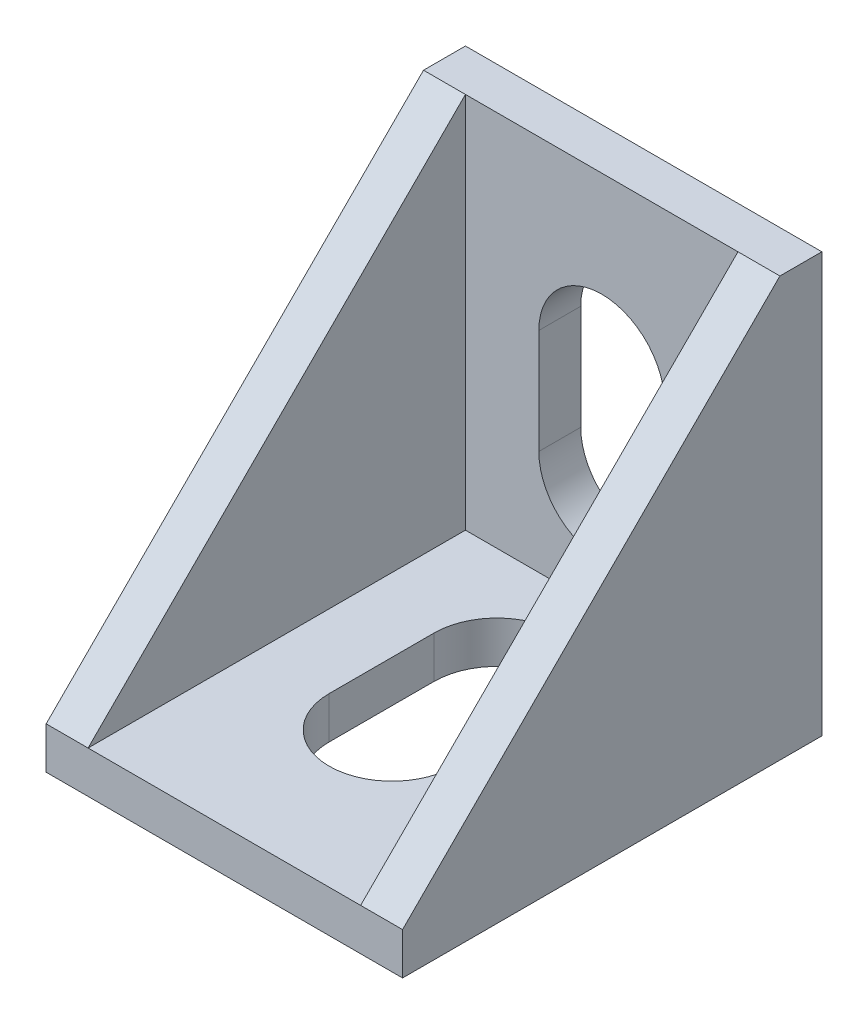
ISO-10303-21;
HEADER;
FILE_DESCRIPTION(('STEP AP214'),'2;1');
FILE_NAME('part.step','',(''),(''),'','','');
FILE_SCHEMA(('AUTOMOTIVE_DESIGN { 1 0 10303 214 1 1 1 1 }'));
ENDSEC;
DATA;
#1=APPLICATION_CONTEXT('core data for automotive mechanical design processes');
#2=APPLICATION_PROTOCOL_DEFINITION('international standard','automotive_design',2000,#1);
#3=PRODUCT_CONTEXT('',#1,'mechanical');
#4=PRODUCT('Part','Part','',(#3));
#5=PRODUCT_RELATED_PRODUCT_CATEGORY('part','',(#4));
#6=PRODUCT_DEFINITION_FORMATION('','',#4);
#7=PRODUCT_DEFINITION_CONTEXT('part definition',#1,'design');
#8=PRODUCT_DEFINITION('design','',#6,#7);
#9=PRODUCT_DEFINITION_SHAPE('','',#8);
#10=(LENGTH_UNIT() NAMED_UNIT(*) SI_UNIT(.MILLI.,.METRE.));
#11=(NAMED_UNIT(*) PLANE_ANGLE_UNIT() SI_UNIT($,.RADIAN.));
#12=(NAMED_UNIT(*) SI_UNIT($,.STERADIAN.) SOLID_ANGLE_UNIT());
#13=UNCERTAINTY_MEASURE_WITH_UNIT(LENGTH_MEASURE(1.E-05),#10,'distance_accuracy_value','');
#14=(GEOMETRIC_REPRESENTATION_CONTEXT(3) GLOBAL_UNCERTAINTY_ASSIGNED_CONTEXT((#13)) GLOBAL_UNIT_ASSIGNED_CONTEXT((#10,
#11,#12)) REPRESENTATION_CONTEXT('',''));
#15=CARTESIAN_POINT('',(0.,0.,0.));
#16=DIRECTION('',(0.,0.,1.));
#17=DIRECTION('',(1.,0.,0.));
#18=AXIS2_PLACEMENT_3D('',#15,#16,#17);
#19=CARTESIAN_POINT('',(0.,0.,0.));
#20=DIRECTION('',(0.,0.,-1.));
#21=DIRECTION('',(-1.,0.,0.));
#22=AXIS2_PLACEMENT_3D('',#19,#20,#21);
#23=PLANE('',#22);
#24=CARTESIAN_POINT('',(-1.,-7.99999999999999,0.));
#25=DIRECTION('',(0.,0.,-1.));
#26=DIRECTION('',(-1.,0.,0.));
#27=AXIS2_PLACEMENT_3D('',#24,#25,#26);
#28=CIRCLE('',#27,1.);
#29=CARTESIAN_POINT('',(-1.,-9.,0.));
#30=VERTEX_POINT('',#29);
#31=CARTESIAN_POINT('',(-1.,-6.99999999999999,0.));
#32=VERTEX_POINT('',#31);
#33=EDGE_CURVE('E59',#30,#32,#28,.T.);
#34=ORIENTED_EDGE('',*,*,#33,.F.);
#35=DIRECTION('',(-1.,0.,0.));
#36=VECTOR('',#35,1.);
#37=CARTESIAN_POINT('',(-1.,-9.,0.));
#38=LINE('',#37,#36);
#39=CARTESIAN_POINT('',(1.,-9.,0.));
#40=VERTEX_POINT('',#39);
#41=EDGE_CURVE('E279',#40,#30,#38,.T.);
#42=ORIENTED_EDGE('',*,*,#41,.F.);
#43=CARTESIAN_POINT('',(1.,-7.99999999999999,0.));
#44=DIRECTION('',(0.,0.,-1.));
#45=DIRECTION('',(-1.,0.,0.));
#46=AXIS2_PLACEMENT_3D('',#43,#44,#45);
#47=CIRCLE('',#46,1.);
#48=CARTESIAN_POINT('',(1.,-6.99999999999999,0.));
#49=VERTEX_POINT('',#48);
#50=EDGE_CURVE('E288',#49,#40,#47,.T.);
#51=ORIENTED_EDGE('',*,*,#50,.F.);
#52=DIRECTION('',(1.,0.,0.));
#53=VECTOR('',#52,1.);
#54=CARTESIAN_POINT('',(-1.,-6.99999999999999,0.));
#55=LINE('',#54,#53);
#56=EDGE_CURVE('E270',#32,#49,#55,.T.);
#57=ORIENTED_EDGE('',*,*,#56,.F.);
#58=EDGE_LOOP('',(#34,#42,#51,#57));
#59=FACE_BOUND('',#58,.T.);
#60=CARTESIAN_POINT('',(0.,-3.,0.));
#61=DIRECTION('',(0.,0.,-1.));
#62=DIRECTION('',(-1.,0.,0.));
#63=AXIS2_PLACEMENT_3D('',#60,#61,#62);
#64=CIRCLE('',#63,3.);
#65=CARTESIAN_POINT('',(-3.,-3.,0.));
#66=VERTEX_POINT('',#65);
#67=CARTESIAN_POINT('',(3.,-3.,0.));
#68=VERTEX_POINT('',#67);
#69=EDGE_CURVE('E375',#66,#68,#64,.F.);
#70=ORIENTED_EDGE('',*,*,#69,.T.);
#71=DIRECTION('',(0.,1.,0.));
#72=VECTOR('',#71,1.);
#73=CARTESIAN_POINT('',(3.,-3.,0.));
#74=LINE('',#73,#72);
#75=CARTESIAN_POINT('',(3.,2.,0.));
#76=VERTEX_POINT('',#75);
#77=EDGE_CURVE('E392',#68,#76,#74,.T.);
#78=ORIENTED_EDGE('',*,*,#77,.T.);
#79=CARTESIAN_POINT('',(0.,2.,0.));
#80=DIRECTION('',(0.,0.,-1.));
#81=DIRECTION('',(-1.,0.,0.));
#82=AXIS2_PLACEMENT_3D('',#79,#80,#81);
#83=CIRCLE('',#82,3.);
#84=CARTESIAN_POINT('',(-3.,2.,0.));
#85=VERTEX_POINT('',#84);
#86=EDGE_CURVE('E369',#76,#85,#83,.F.);
#87=ORIENTED_EDGE('',*,*,#86,.T.);
#88=DIRECTION('',(0.,-1.,0.));
#89=VECTOR('',#88,1.);
#90=CARTESIAN_POINT('',(-3.,-3.,0.));
#91=LINE('',#90,#89);
#92=EDGE_CURVE('E372',#85,#66,#91,.T.);
#93=ORIENTED_EDGE('',*,*,#92,.T.);
#94=EDGE_LOOP('',(#70,#78,#87,#93));
#95=FACE_BOUND('',#94,.T.);
#96=DIRECTION('',(0.,1.,0.));
#97=VECTOR('',#96,1.);
#98=CARTESIAN_POINT('',(8.5,-10.,0.));
#99=LINE('',#98,#97);
#100=CARTESIAN_POINT('',(8.5,-10.,0.));
#101=VERTEX_POINT('',#100);
#102=CARTESIAN_POINT('',(8.5,10.,0.));
#103=VERTEX_POINT('',#102);
#104=EDGE_CURVE('E470',#101,#103,#99,.T.);
#105=ORIENTED_EDGE('',*,*,#104,.F.);
#106=DIRECTION('',(1.,0.,0.));
#107=VECTOR('',#106,1.);
#108=CARTESIAN_POINT('',(-8.5,-10.,0.));
#109=LINE('',#108,#107);
#110=CARTESIAN_POINT('',(-8.5,-10.,0.));
#111=VERTEX_POINT('',#110);
#112=EDGE_CURVE('E477',#111,#101,#109,.T.);
#113=ORIENTED_EDGE('',*,*,#112,.F.);
#114=DIRECTION('',(0.,-1.,0.));
#115=VECTOR('',#114,1.);
#116=CARTESIAN_POINT('',(-8.5,-10.,0.));
#117=LINE('',#116,#115);
#118=CARTESIAN_POINT('',(-8.5,10.,0.));
#119=VERTEX_POINT('',#118);
#120=EDGE_CURVE('E487',#119,#111,#117,.T.);
#121=ORIENTED_EDGE('',*,*,#120,.F.);
#122=DIRECTION('',(-1.,0.,0.));
#123=VECTOR('',#122,1.);
#124=CARTESIAN_POINT('',(-8.5,10.,0.));
#125=LINE('',#124,#123);
#126=EDGE_CURVE('E484',#103,#119,#125,.T.);
#127=ORIENTED_EDGE('',*,*,#126,.F.);
#128=EDGE_LOOP('',(#105,#113,#121,#127));
#129=FACE_BOUND('',#128,.T.);
#130=DIRECTION('',(1.,0.,0.));
#131=VECTOR('',#130,1.);
#132=CARTESIAN_POINT('',(-1.,9.,0.));
#133=LINE('',#132,#131);
#134=CARTESIAN_POINT('',(-1.,9.,0.));
#135=VERTEX_POINT('',#134);
#136=CARTESIAN_POINT('',(1.,9.,0.));
#137=VERTEX_POINT('',#136);
#138=EDGE_CURVE('E931',#135,#137,#133,.T.);
#139=ORIENTED_EDGE('',*,*,#138,.F.);
#140=CARTESIAN_POINT('',(-1.,8.,0.));
#141=DIRECTION('',(0.,0.,-1.));
#142=DIRECTION('',(-1.,0.,0.));
#143=AXIS2_PLACEMENT_3D('',#140,#141,#142);
#144=CIRCLE('',#143,0.999999999999999);
#145=CARTESIAN_POINT('',(-1.,7.,0.));
#146=VERTEX_POINT('',#145);
#147=EDGE_CURVE('E267',#146,#135,#144,.T.);
#148=ORIENTED_EDGE('',*,*,#147,.F.);
#149=DIRECTION('',(-1.,0.,0.));
#150=VECTOR('',#149,1.);
#151=CARTESIAN_POINT('',(-1.,7.,0.));
#152=LINE('',#151,#150);
#153=CARTESIAN_POINT('',(1.,7.,0.));
#154=VERTEX_POINT('',#153);
#155=EDGE_CURVE('E263',#154,#146,#152,.T.);
#156=ORIENTED_EDGE('',*,*,#155,.F.);
#157=CARTESIAN_POINT('',(1.,8.,0.));
#158=DIRECTION('',(0.,0.,-1.));
#159=DIRECTION('',(-1.,0.,0.));
#160=AXIS2_PLACEMENT_3D('',#157,#158,#159);
#161=CIRCLE('',#160,0.999999999999999);
#162=EDGE_CURVE('E928',#137,#154,#161,.T.);
#163=ORIENTED_EDGE('',*,*,#162,.F.);
#164=EDGE_LOOP('',(#139,#148,#156,#163));
#165=FACE_BOUND('',#164,.T.);
#166=ADVANCED_FACE('F36',(#59,#95,#129,#165),#23,.T.);
#167=CARTESIAN_POINT('',(-8.5,-10.,20.));
#168=DIRECTION('',(0.,1.,0.));
#169=DIRECTION('',(0.,0.,1.));
#170=AXIS2_PLACEMENT_3D('',#167,#168,#169);
#171=PLANE('',#170);
#172=CARTESIAN_POINT('',(-1.,-10.,18.));
#173=DIRECTION('',(0.,-1.,0.));
#174=DIRECTION('',(0.,0.,-1.));
#175=AXIS2_PLACEMENT_3D('',#172,#173,#174);
#176=CIRCLE('',#175,1.);
#177=CARTESIAN_POINT('',(-1.,-10.,19.));
#178=VERTEX_POINT('',#177);
#179=CARTESIAN_POINT('',(-1.,-10.,17.));
#180=VERTEX_POINT('',#179);
#181=EDGE_CURVE('E336',#178,#180,#176,.T.);
#182=ORIENTED_EDGE('',*,*,#181,.F.);
#183=DIRECTION('',(-1.,0.,0.));
#184=VECTOR('',#183,1.);
#185=CARTESIAN_POINT('',(-1.,-10.,19.));
#186=LINE('',#185,#184);
#187=CARTESIAN_POINT('',(1.,-10.,19.));
#188=VERTEX_POINT('',#187);
#189=EDGE_CURVE('E341',#188,#178,#186,.T.);
#190=ORIENTED_EDGE('',*,*,#189,.F.);
#191=CARTESIAN_POINT('',(1.,-10.,18.));
#192=DIRECTION('',(0.,-1.,0.));
#193=DIRECTION('',(0.,0.,-1.));
#194=AXIS2_PLACEMENT_3D('',#191,#192,#193);
#195=CIRCLE('',#194,1.);
#196=CARTESIAN_POINT('',(1.,-10.,17.));
#197=VERTEX_POINT('',#196);
#198=EDGE_CURVE('E353',#197,#188,#195,.T.);
#199=ORIENTED_EDGE('',*,*,#198,.F.);
#200=DIRECTION('',(1.,0.,0.));
#201=VECTOR('',#200,1.);
#202=CARTESIAN_POINT('',(-1.,-10.,17.));
#203=LINE('',#202,#201);
#204=EDGE_CURVE('E350',#180,#197,#203,.T.);
#205=ORIENTED_EDGE('',*,*,#204,.F.);
#206=EDGE_LOOP('',(#182,#190,#199,#205));
#207=FACE_BOUND('',#206,.T.);
#208=DIRECTION('',(0.,0.,-1.));
#209=VECTOR('',#208,1.);
#210=CARTESIAN_POINT('',(-3.,-10.,12.));
#211=LINE('',#210,#209);
#212=CARTESIAN_POINT('',(-3.,-10.,12.));
#213=VERTEX_POINT('',#212);
#214=CARTESIAN_POINT('',(-3.,-10.,7.));
#215=VERTEX_POINT('',#214);
#216=EDGE_CURVE('E403',#213,#215,#211,.T.);
#217=ORIENTED_EDGE('',*,*,#216,.F.);
#218=CARTESIAN_POINT('',(0.,-10.,12.));
#219=DIRECTION('',(0.,1.,0.));
#220=DIRECTION('',(0.,0.,1.));
#221=AXIS2_PLACEMENT_3D('',#218,#219,#220);
#222=CIRCLE('',#221,3.);
#223=CARTESIAN_POINT('',(3.,-10.,12.));
#224=VERTEX_POINT('',#223);
#225=EDGE_CURVE('E406',#224,#213,#222,.F.);
#226=ORIENTED_EDGE('',*,*,#225,.F.);
#227=DIRECTION('',(0.,0.,1.));
#228=VECTOR('',#227,1.);
#229=CARTESIAN_POINT('',(3.,-10.,12.));
#230=LINE('',#229,#228);
#231=CARTESIAN_POINT('',(3.,-10.,7.));
#232=VERTEX_POINT('',#231);
#233=EDGE_CURVE('E423',#232,#224,#230,.T.);
#234=ORIENTED_EDGE('',*,*,#233,.F.);
#235=CARTESIAN_POINT('',(0.,-10.,7.));
#236=DIRECTION('',(0.,1.,0.));
#237=DIRECTION('',(0.,0.,1.));
#238=AXIS2_PLACEMENT_3D('',#235,#236,#237);
#239=CIRCLE('',#238,3.);
#240=EDGE_CURVE('E401',#215,#232,#239,.F.);
#241=ORIENTED_EDGE('',*,*,#240,.F.);
#242=EDGE_LOOP('',(#217,#226,#234,#241));
#243=FACE_BOUND('',#242,.T.);
#244=ORIENTED_EDGE('',*,*,#112,.T.);
#245=DIRECTION('',(0.,0.,-1.));
#246=VECTOR('',#245,1.);
#247=CARTESIAN_POINT('',(8.5,-10.,20.));
#248=LINE('',#247,#246);
#249=CARTESIAN_POINT('',(8.5,-10.,20.));
#250=VERTEX_POINT('',#249);
#251=EDGE_CURVE('E481',#250,#101,#248,.T.);
#252=ORIENTED_EDGE('',*,*,#251,.F.);
#253=DIRECTION('',(1.,0.,0.));
#254=VECTOR('',#253,1.);
#255=CARTESIAN_POINT('',(-8.5,-10.,20.));
#256=LINE('',#255,#254);
#257=CARTESIAN_POINT('',(-8.5,-10.,20.));
#258=VERTEX_POINT('',#257);
#259=EDGE_CURVE('E479',#258,#250,#256,.T.);
#260=ORIENTED_EDGE('',*,*,#259,.F.);
#261=DIRECTION('',(0.,0.,-1.));
#262=VECTOR('',#261,1.);
#263=CARTESIAN_POINT('',(-8.5,-10.,20.));
#264=LINE('',#263,#262);
#265=EDGE_CURVE('E492',#258,#111,#264,.T.);
#266=ORIENTED_EDGE('',*,*,#265,.T.);
#267=EDGE_LOOP('',(#244,#252,#260,#266));
#268=FACE_BOUND('',#267,.T.);
#269=CARTESIAN_POINT('',(-0.999999999999998,-10.,2.));
#270=DIRECTION('',(0.,-1.,0.));
#271=DIRECTION('',(0.,0.,-1.));
#272=AXIS2_PLACEMENT_3D('',#269,#270,#271);
#273=CIRCLE('',#272,1.);
#274=CARTESIAN_POINT('',(-0.999999999999998,-10.,3.));
#275=VERTEX_POINT('',#274);
#276=CARTESIAN_POINT('',(-0.999999999999998,-10.,1.));
#277=VERTEX_POINT('',#276);
#278=EDGE_CURVE('E303',#275,#277,#273,.T.);
#279=ORIENTED_EDGE('',*,*,#278,.F.);
#280=DIRECTION('',(-1.,0.,0.));
#281=VECTOR('',#280,1.);
#282=CARTESIAN_POINT('',(-0.999999999999998,-10.,3.));
#283=LINE('',#282,#281);
#284=CARTESIAN_POINT('',(1.,-10.,3.));
#285=VERTEX_POINT('',#284);
#286=EDGE_CURVE('E308',#285,#275,#283,.T.);
#287=ORIENTED_EDGE('',*,*,#286,.F.);
#288=CARTESIAN_POINT('',(1.,-10.,2.));
#289=DIRECTION('',(0.,-1.,0.));
#290=DIRECTION('',(0.,0.,-1.));
#291=AXIS2_PLACEMENT_3D('',#288,#289,#290);
#292=CIRCLE('',#291,1.);
#293=CARTESIAN_POINT('',(1.,-10.,1.));
#294=VERTEX_POINT('',#293);
#295=EDGE_CURVE('E320',#294,#285,#292,.T.);
#296=ORIENTED_EDGE('',*,*,#295,.F.);
#297=DIRECTION('',(1.,0.,0.));
#298=VECTOR('',#297,1.);
#299=CARTESIAN_POINT('',(-0.999999999999998,-10.,1.));
#300=LINE('',#299,#298);
#301=EDGE_CURVE('E317',#277,#294,#300,.T.);
#302=ORIENTED_EDGE('',*,*,#301,.F.);
#303=EDGE_LOOP('',(#279,#287,#296,#302));
#304=FACE_BOUND('',#303,.T.);
#305=ADVANCED_FACE('F511',(#207,#243,#268,#304),#171,.F.);
#306=CARTESIAN_POINT('',(8.5,-10.,20.));
#307=DIRECTION('',(-1.,0.,0.));
#308=DIRECTION('',(0.,0.,1.));
#309=AXIS2_PLACEMENT_3D('',#306,#307,#308);
#310=PLANE('',#309);
#311=DIRECTION('',(0.,0.,-1.));
#312=VECTOR('',#311,1.);
#313=CARTESIAN_POINT('',(8.5,10.,20.));
#314=LINE('',#313,#312);
#315=CARTESIAN_POINT('',(8.5,10.,2.));
#316=VERTEX_POINT('',#315);
#317=EDGE_CURVE('E11',#316,#103,#314,.T.);
#318=ORIENTED_EDGE('',*,*,#317,.F.);
#319=DIRECTION('',(0.,-0.707106781186548,0.707106781186548));
#320=VECTOR('',#319,1.);
#321=CARTESIAN_POINT('',(8.5,-9.,21.));
#322=LINE('',#321,#320);
#323=CARTESIAN_POINT('',(8.5,-8.,20.));
#324=VERTEX_POINT('',#323);
#325=EDGE_CURVE('E448',#316,#324,#322,.T.);
#326=ORIENTED_EDGE('',*,*,#325,.T.);
#327=DIRECTION('',(0.,1.,0.));
#328=VECTOR('',#327,1.);
#329=CARTESIAN_POINT('',(8.5,-10.,20.));
#330=LINE('',#329,#328);
#331=EDGE_CURVE('E473',#250,#324,#330,.T.);
#332=ORIENTED_EDGE('',*,*,#331,.F.);
#333=ORIENTED_EDGE('',*,*,#251,.T.);
#334=ORIENTED_EDGE('',*,*,#104,.T.);
#335=EDGE_LOOP('',(#318,#326,#332,#333,#334));
#336=FACE_BOUND('',#335,.T.);
#337=ADVANCED_FACE('F38',(#336),#310,.F.);
#338=CARTESIAN_POINT('',(-8.5,10.,20.));
#339=DIRECTION('',(0.,-1.,0.));
#340=DIRECTION('',(0.,0.,-1.));
#341=AXIS2_PLACEMENT_3D('',#338,#339,#340);
#342=PLANE('',#341);
#343=DIRECTION('',(0.,0.,-1.));
#344=VECTOR('',#343,1.);
#345=CARTESIAN_POINT('',(-8.5,10.,20.));
#346=LINE('',#345,#344);
#347=CARTESIAN_POINT('',(-8.5,10.,2.));
#348=VERTEX_POINT('',#347);
#349=EDGE_CURVE('E44',#348,#119,#346,.T.);
#350=ORIENTED_EDGE('',*,*,#349,.F.);
#351=DIRECTION('',(1.,0.,0.));
#352=VECTOR('',#351,1.);
#353=CARTESIAN_POINT('',(-8.5,10.,2.));
#354=LINE('',#353,#352);
#355=CARTESIAN_POINT('',(-6.5,10.,2.));
#356=VERTEX_POINT('',#355);
#357=EDGE_CURVE('E436',#348,#356,#354,.T.);
#358=ORIENTED_EDGE('',*,*,#357,.T.);
#359=DIRECTION('',(-1.,0.,0.));
#360=VECTOR('',#359,1.);
#361=CARTESIAN_POINT('',(-6.5,10.,2.));
#362=LINE('',#361,#360);
#363=CARTESIAN_POINT('',(6.5,10.,2.));
#364=VERTEX_POINT('',#363);
#365=EDGE_CURVE('E451',#364,#356,#362,.T.);
#366=ORIENTED_EDGE('',*,*,#365,.F.);
#367=EDGE_CURVE('E440',#364,#316,#354,.T.);
#368=ORIENTED_EDGE('',*,*,#367,.T.);
#369=ORIENTED_EDGE('',*,*,#317,.T.);
#370=ORIENTED_EDGE('',*,*,#126,.T.);
#371=EDGE_LOOP('',(#350,#358,#366,#368,#369,#370));
#372=FACE_BOUND('',#371,.T.);
#373=ADVANCED_FACE('F502',(#372),#342,.F.);
#374=CARTESIAN_POINT('',(-8.5,-10.,20.));
#375=DIRECTION('',(1.,0.,0.));
#376=DIRECTION('',(0.,0.,-1.));
#377=AXIS2_PLACEMENT_3D('',#374,#375,#376);
#378=PLANE('',#377);
#379=DIRECTION('',(0.,-1.,0.));
#380=VECTOR('',#379,1.);
#381=CARTESIAN_POINT('',(-8.5,-10.,20.));
#382=LINE('',#381,#380);
#383=CARTESIAN_POINT('',(-8.5,-8.,20.));
#384=VERTEX_POINT('',#383);
#385=EDGE_CURVE('E476',#384,#258,#382,.T.);
#386=ORIENTED_EDGE('',*,*,#385,.F.);
#387=DIRECTION('',(0.,0.707106781186547,-0.707106781186547));
#388=VECTOR('',#387,1.);
#389=CARTESIAN_POINT('',(-8.5,10.,2.));
#390=LINE('',#389,#388);
#391=EDGE_CURVE('E432',#384,#348,#390,.T.);
#392=ORIENTED_EDGE('',*,*,#391,.T.);
#393=ORIENTED_EDGE('',*,*,#349,.T.);
#394=ORIENTED_EDGE('',*,*,#120,.T.);
#395=ORIENTED_EDGE('',*,*,#265,.F.);
#396=EDGE_LOOP('',(#386,#392,#393,#394,#395));
#397=FACE_BOUND('',#396,.T.);
#398=ADVANCED_FACE('F497',(#397),#378,.F.);
#399=CARTESIAN_POINT('',(0.,0.,20.));
#400=DIRECTION('',(0.,0.,-1.));
#401=DIRECTION('',(-1.,0.,0.));
#402=AXIS2_PLACEMENT_3D('',#399,#400,#401);
#403=PLANE('',#402);
#404=ORIENTED_EDGE('',*,*,#331,.T.);
#405=DIRECTION('',(1.,0.,0.));
#406=VECTOR('',#405,1.);
#407=CARTESIAN_POINT('',(-8.5,-8.,20.));
#408=LINE('',#407,#406);
#409=CARTESIAN_POINT('',(6.5,-8.,20.));
#410=VERTEX_POINT('',#409);
#411=EDGE_CURVE('E435',#410,#324,#408,.T.);
#412=ORIENTED_EDGE('',*,*,#411,.F.);
#413=DIRECTION('',(1.,0.,0.));
#414=VECTOR('',#413,1.);
#415=CARTESIAN_POINT('',(-6.5,-8.,20.));
#416=LINE('',#415,#414);
#417=CARTESIAN_POINT('',(-6.5,-8.,20.));
#418=VERTEX_POINT('',#417);
#419=EDGE_CURVE('E455',#418,#410,#416,.T.);
#420=ORIENTED_EDGE('',*,*,#419,.F.);
#421=EDGE_CURVE('E441',#384,#418,#408,.T.);
#422=ORIENTED_EDGE('',*,*,#421,.F.);
#423=ORIENTED_EDGE('',*,*,#385,.T.);
#424=ORIENTED_EDGE('',*,*,#259,.T.);
#425=EDGE_LOOP('',(#404,#412,#420,#422,#423,#424));
#426=FACE_BOUND('',#425,.T.);
#427=ADVANCED_FACE('F518',(#426),#403,.F.);
#428=CARTESIAN_POINT('',(-6.5,-8.,20.));
#429=DIRECTION('',(-1.,0.,0.));
#430=DIRECTION('',(0.,0.,1.));
#431=AXIS2_PLACEMENT_3D('',#428,#429,#430);
#432=PLANE('',#431);
#433=DIRECTION('',(0.,1.,0.));
#434=VECTOR('',#433,1.);
#435=CARTESIAN_POINT('',(-6.5,-8.,2.));
#436=LINE('',#435,#434);
#437=CARTESIAN_POINT('',(-6.5,-8.,2.));
#438=VERTEX_POINT('',#437);
#439=EDGE_CURVE('E467',#438,#356,#436,.T.);
#440=ORIENTED_EDGE('',*,*,#439,.T.);
#441=DIRECTION('',(0.,-0.707106781186548,0.707106781186548));
#442=VECTOR('',#441,1.);
#443=CARTESIAN_POINT('',(-6.5,-8.,20.));
#444=LINE('',#443,#442);
#445=EDGE_CURVE('E445',#356,#418,#444,.T.);
#446=ORIENTED_EDGE('',*,*,#445,.T.);
#447=DIRECTION('',(0.,0.,1.));
#448=VECTOR('',#447,1.);
#449=CARTESIAN_POINT('',(-6.5,-8.,20.));
#450=LINE('',#449,#448);
#451=EDGE_CURVE('E452',#438,#418,#450,.T.);
#452=ORIENTED_EDGE('',*,*,#451,.F.);
#453=EDGE_LOOP('',(#440,#446,#452));
#454=FACE_BOUND('',#453,.T.);
#455=ADVANCED_FACE('F526',(#454),#432,.F.);
#456=CARTESIAN_POINT('',(-6.5,-8.,2.));
#457=DIRECTION('',(0.,0.,-1.));
#458=DIRECTION('',(-1.,0.,0.));
#459=AXIS2_PLACEMENT_3D('',#456,#457,#458);
#460=PLANE('',#459);
#461=DIRECTION('',(0.,1.,0.));
#462=VECTOR('',#461,1.);
#463=CARTESIAN_POINT('',(3.,-3.,2.));
#464=LINE('',#463,#462);
#465=CARTESIAN_POINT('',(3.,-3.,2.));
#466=VERTEX_POINT('',#465);
#467=CARTESIAN_POINT('',(3.,2.,2.));
#468=VERTEX_POINT('',#467);
#469=EDGE_CURVE('E380',#466,#468,#464,.T.);
#470=ORIENTED_EDGE('',*,*,#469,.F.);
#471=CARTESIAN_POINT('',(0.,-3.,2.));
#472=DIRECTION('',(0.,0.,1.));
#473=DIRECTION('',(1.,0.,0.));
#474=AXIS2_PLACEMENT_3D('',#471,#472,#473);
#475=CIRCLE('',#474,3.);
#476=CARTESIAN_POINT('',(-3.,-3.,2.));
#477=VERTEX_POINT('',#476);
#478=EDGE_CURVE('E378',#477,#466,#475,.T.);
#479=ORIENTED_EDGE('',*,*,#478,.F.);
#480=DIRECTION('',(0.,-1.,0.));
#481=VECTOR('',#480,1.);
#482=CARTESIAN_POINT('',(-3.,-3.,2.));
#483=LINE('',#482,#481);
#484=CARTESIAN_POINT('',(-3.,2.,2.));
#485=VERTEX_POINT('',#484);
#486=EDGE_CURVE('E386',#485,#477,#483,.T.);
#487=ORIENTED_EDGE('',*,*,#486,.F.);
#488=CARTESIAN_POINT('',(0.,2.,2.));
#489=DIRECTION('',(0.,0.,1.));
#490=DIRECTION('',(1.,0.,0.));
#491=AXIS2_PLACEMENT_3D('',#488,#489,#490);
#492=CIRCLE('',#491,3.);
#493=EDGE_CURVE('E383',#468,#485,#492,.T.);
#494=ORIENTED_EDGE('',*,*,#493,.F.);
#495=EDGE_LOOP('',(#470,#479,#487,#494));
#496=FACE_BOUND('',#495,.T.);
#497=ORIENTED_EDGE('',*,*,#365,.T.);
#498=ORIENTED_EDGE('',*,*,#439,.F.);
#499=DIRECTION('',(-1.,0.,0.));
#500=VECTOR('',#499,1.);
#501=CARTESIAN_POINT('',(-6.5,-8.,2.));
#502=LINE('',#501,#500);
#503=CARTESIAN_POINT('',(6.5,-8.,2.));
#504=VERTEX_POINT('',#503);
#505=EDGE_CURVE('E461',#504,#438,#502,.T.);
#506=ORIENTED_EDGE('',*,*,#505,.F.);
#507=DIRECTION('',(0.,1.,0.));
#508=VECTOR('',#507,1.);
#509=CARTESIAN_POINT('',(6.5,-8.,2.));
#510=LINE('',#509,#508);
#511=EDGE_CURVE('E464',#504,#364,#510,.T.);
#512=ORIENTED_EDGE('',*,*,#511,.T.);
#513=EDGE_LOOP('',(#497,#498,#506,#512));
#514=FACE_BOUND('',#513,.T.);
#515=ADVANCED_FACE('F531',(#496,#514),#460,.F.);
#516=CARTESIAN_POINT('',(6.5,-8.,20.));
#517=DIRECTION('',(1.,0.,0.));
#518=DIRECTION('',(0.,0.,-1.));
#519=AXIS2_PLACEMENT_3D('',#516,#517,#518);
#520=PLANE('',#519);
#521=DIRECTION('',(0.,0.,-1.));
#522=VECTOR('',#521,1.);
#523=CARTESIAN_POINT('',(6.5,-8.,20.));
#524=LINE('',#523,#522);
#525=EDGE_CURVE('E458',#410,#504,#524,.T.);
#526=ORIENTED_EDGE('',*,*,#525,.F.);
#527=DIRECTION('',(0.,0.707106781186548,-0.707106781186548));
#528=VECTOR('',#527,1.);
#529=CARTESIAN_POINT('',(6.5,-8.,20.));
#530=LINE('',#529,#528);
#531=EDGE_CURVE('E439',#410,#364,#530,.T.);
#532=ORIENTED_EDGE('',*,*,#531,.T.);
#533=ORIENTED_EDGE('',*,*,#511,.F.);
#534=EDGE_LOOP('',(#526,#532,#533));
#535=FACE_BOUND('',#534,.T.);
#536=ADVANCED_FACE('F536',(#535),#520,.F.);
#537=CARTESIAN_POINT('',(0.,-8.,0.));
#538=DIRECTION('',(0.,-1.,0.));
#539=DIRECTION('',(0.,0.,-1.));
#540=AXIS2_PLACEMENT_3D('',#537,#538,#539);
#541=PLANE('',#540);
#542=DIRECTION('',(0.,0.,-1.));
#543=VECTOR('',#542,1.);
#544=CARTESIAN_POINT('',(3.,-8.,12.));
#545=LINE('',#544,#543);
#546=CARTESIAN_POINT('',(3.,-8.,12.));
#547=VERTEX_POINT('',#546);
#548=CARTESIAN_POINT('',(3.,-8.,7.));
#549=VERTEX_POINT('',#548);
#550=EDGE_CURVE('E411',#547,#549,#545,.T.);
#551=ORIENTED_EDGE('',*,*,#550,.F.);
#552=CARTESIAN_POINT('',(0.,-8.,12.));
#553=DIRECTION('',(0.,1.,0.));
#554=DIRECTION('',(0.,0.,1.));
#555=AXIS2_PLACEMENT_3D('',#552,#553,#554);
#556=CIRCLE('',#555,3.);
#557=CARTESIAN_POINT('',(-3.,-8.,12.));
#558=VERTEX_POINT('',#557);
#559=EDGE_CURVE('E409',#558,#547,#556,.T.);
#560=ORIENTED_EDGE('',*,*,#559,.F.);
#561=DIRECTION('',(0.,0.,1.));
#562=VECTOR('',#561,1.);
#563=CARTESIAN_POINT('',(-3.,-8.,12.));
#564=LINE('',#563,#562);
#565=CARTESIAN_POINT('',(-3.,-8.,7.));
#566=VERTEX_POINT('',#565);
#567=EDGE_CURVE('E417',#566,#558,#564,.T.);
#568=ORIENTED_EDGE('',*,*,#567,.F.);
#569=CARTESIAN_POINT('',(0.,-8.,7.));
#570=DIRECTION('',(0.,1.,0.));
#571=DIRECTION('',(0.,0.,1.));
#572=AXIS2_PLACEMENT_3D('',#569,#570,#571);
#573=CIRCLE('',#572,3.);
#574=EDGE_CURVE('E414',#549,#566,#573,.T.);
#575=ORIENTED_EDGE('',*,*,#574,.F.);
#576=EDGE_LOOP('',(#551,#560,#568,#575));
#577=FACE_BOUND('',#576,.T.);
#578=ORIENTED_EDGE('',*,*,#451,.T.);
#579=ORIENTED_EDGE('',*,*,#419,.T.);
#580=ORIENTED_EDGE('',*,*,#525,.T.);
#581=ORIENTED_EDGE('',*,*,#505,.T.);
#582=EDGE_LOOP('',(#578,#579,#580,#581));
#583=FACE_BOUND('',#582,.T.);
#584=ADVANCED_FACE('F528',(#577,#583),#541,.F.);
#585=CARTESIAN_POINT('',(-8.5,10.,2.));
#586=DIRECTION('',(0.,-0.707106781186548,-0.707106781186548));
#587=DIRECTION('',(0.,0.707106781186548,-0.707106781186548));
#588=AXIS2_PLACEMENT_3D('',#585,#586,#587);
#589=PLANE('',#588);
#590=ORIENTED_EDGE('',*,*,#367,.F.);
#591=ORIENTED_EDGE('',*,*,#531,.F.);
#592=ORIENTED_EDGE('',*,*,#411,.T.);
#593=ORIENTED_EDGE('',*,*,#325,.F.);
#594=EDGE_LOOP('',(#590,#591,#592,#593));
#595=FACE_BOUND('',#594,.T.);
#596=ADVANCED_FACE('F534',(#595),#589,.F.);
#597=ORIENTED_EDGE('',*,*,#357,.F.);
#598=ORIENTED_EDGE('',*,*,#391,.F.);
#599=ORIENTED_EDGE('',*,*,#421,.T.);
#600=ORIENTED_EDGE('',*,*,#445,.F.);
#601=EDGE_LOOP('',(#597,#598,#599,#600));
#602=FACE_BOUND('',#601,.T.);
#603=ADVANCED_FACE('F523',(#602),#589,.F.);
#604=CARTESIAN_POINT('',(0.,-10.001,12.));
#605=DIRECTION('',(0.,1.,0.));
#606=DIRECTION('',(0.,0.,1.));
#607=AXIS2_PLACEMENT_3D('',#604,#605,#606);
#608=CYLINDRICAL_SURFACE('',#607,3.);
#609=ORIENTED_EDGE('',*,*,#225,.T.);
#610=DIRECTION('',(0.,1.,0.));
#611=VECTOR('',#610,1.);
#612=CARTESIAN_POINT('',(-3.,-10.001,12.));
#613=LINE('',#612,#611);
#614=EDGE_CURVE('E421',#213,#558,#613,.T.);
#615=ORIENTED_EDGE('',*,*,#614,.T.);
#616=ORIENTED_EDGE('',*,*,#559,.T.);
#617=DIRECTION('',(0.,1.,0.));
#618=VECTOR('',#617,1.);
#619=CARTESIAN_POINT('',(3.,-10.001,12.));
#620=LINE('',#619,#618);
#621=EDGE_CURVE('E420',#224,#547,#620,.T.);
#622=ORIENTED_EDGE('',*,*,#621,.F.);
#623=EDGE_LOOP('',(#609,#615,#616,#622));
#624=FACE_BOUND('',#623,.T.);
#625=ADVANCED_FACE('F796',(#624),#608,.F.);
#626=CARTESIAN_POINT('',(-3.,-10.001,12.));
#627=DIRECTION('',(-1.,0.,0.));
#628=DIRECTION('',(0.,0.,1.));
#629=AXIS2_PLACEMENT_3D('',#626,#627,#628);
#630=PLANE('',#629);
#631=ORIENTED_EDGE('',*,*,#216,.T.);
#632=DIRECTION('',(0.,1.,0.));
#633=VECTOR('',#632,1.);
#634=CARTESIAN_POINT('',(-3.,-10.001,7.));
#635=LINE('',#634,#633);
#636=EDGE_CURVE('E424',#215,#566,#635,.T.);
#637=ORIENTED_EDGE('',*,*,#636,.T.);
#638=ORIENTED_EDGE('',*,*,#567,.T.);
#639=ORIENTED_EDGE('',*,*,#614,.F.);
#640=EDGE_LOOP('',(#631,#637,#638,#639));
#641=FACE_BOUND('',#640,.T.);
#642=ADVANCED_FACE('F792',(#641),#630,.F.);
#643=CARTESIAN_POINT('',(0.,-10.001,7.));
#644=DIRECTION('',(0.,1.,0.));
#645=DIRECTION('',(0.,0.,1.));
#646=AXIS2_PLACEMENT_3D('',#643,#644,#645);
#647=CYLINDRICAL_SURFACE('',#646,3.);
#648=ORIENTED_EDGE('',*,*,#240,.T.);
#649=DIRECTION('',(0.,1.,0.));
#650=VECTOR('',#649,1.);
#651=CARTESIAN_POINT('',(3.,-10.001,7.));
#652=LINE('',#651,#650);
#653=EDGE_CURVE('E426',#232,#549,#652,.T.);
#654=ORIENTED_EDGE('',*,*,#653,.T.);
#655=ORIENTED_EDGE('',*,*,#574,.T.);
#656=ORIENTED_EDGE('',*,*,#636,.F.);
#657=EDGE_LOOP('',(#648,#654,#655,#656));
#658=FACE_BOUND('',#657,.T.);
#659=ADVANCED_FACE('F795',(#658),#647,.F.);
#660=CARTESIAN_POINT('',(3.,-10.001,12.));
#661=DIRECTION('',(1.,0.,0.));
#662=DIRECTION('',(0.,0.,-1.));
#663=AXIS2_PLACEMENT_3D('',#660,#661,#662);
#664=PLANE('',#663);
#665=ORIENTED_EDGE('',*,*,#233,.T.);
#666=ORIENTED_EDGE('',*,*,#621,.T.);
#667=ORIENTED_EDGE('',*,*,#550,.T.);
#668=ORIENTED_EDGE('',*,*,#653,.F.);
#669=EDGE_LOOP('',(#665,#666,#667,#668));
#670=FACE_BOUND('',#669,.T.);
#671=ADVANCED_FACE('F790',(#670),#664,.F.);
#672=CARTESIAN_POINT('',(0.,-3.,-0.00100000000000013));
#673=DIRECTION('',(0.,0.,1.));
#674=DIRECTION('',(1.,0.,0.));
#675=AXIS2_PLACEMENT_3D('',#672,#673,#674);
#676=CYLINDRICAL_SURFACE('',#675,3.);
#677=DIRECTION('',(0.,0.,1.));
#678=VECTOR('',#677,1.);
#679=CARTESIAN_POINT('',(-3.,-3.,-0.00100000000000013));
#680=LINE('',#679,#678);
#681=EDGE_CURVE('E390',#66,#477,#680,.T.);
#682=ORIENTED_EDGE('',*,*,#681,.T.);
#683=ORIENTED_EDGE('',*,*,#478,.T.);
#684=DIRECTION('',(0.,0.,1.));
#685=VECTOR('',#684,1.);
#686=CARTESIAN_POINT('',(3.,-3.,-0.00100000000000013));
#687=LINE('',#686,#685);
#688=EDGE_CURVE('E389',#68,#466,#687,.T.);
#689=ORIENTED_EDGE('',*,*,#688,.F.);
#690=ORIENTED_EDGE('',*,*,#69,.F.);
#691=EDGE_LOOP('',(#682,#683,#689,#690));
#692=FACE_BOUND('',#691,.T.);
#693=ADVANCED_FACE('F781',(#692),#676,.F.);
#694=CARTESIAN_POINT('',(-3.,-3.,-0.00100000000000013));
#695=DIRECTION('',(-1.,0.,0.));
#696=DIRECTION('',(0.,0.,1.));
#697=AXIS2_PLACEMENT_3D('',#694,#695,#696);
#698=PLANE('',#697);
#699=DIRECTION('',(0.,0.,1.));
#700=VECTOR('',#699,1.);
#701=CARTESIAN_POINT('',(-3.,2.,-0.00100000000000013));
#702=LINE('',#701,#700);
#703=EDGE_CURVE('E393',#85,#485,#702,.T.);
#704=ORIENTED_EDGE('',*,*,#703,.T.);
#705=ORIENTED_EDGE('',*,*,#486,.T.);
#706=ORIENTED_EDGE('',*,*,#681,.F.);
#707=ORIENTED_EDGE('',*,*,#92,.F.);
#708=EDGE_LOOP('',(#704,#705,#706,#707));
#709=FACE_BOUND('',#708,.T.);
#710=ADVANCED_FACE('F777',(#709),#698,.F.);
#711=CARTESIAN_POINT('',(0.,2.,-0.00100000000000013));
#712=DIRECTION('',(0.,0.,1.));
#713=DIRECTION('',(1.,0.,0.));
#714=AXIS2_PLACEMENT_3D('',#711,#712,#713);
#715=CYLINDRICAL_SURFACE('',#714,3.);
#716=DIRECTION('',(0.,0.,1.));
#717=VECTOR('',#716,1.);
#718=CARTESIAN_POINT('',(3.,2.,-0.00100000000000013));
#719=LINE('',#718,#717);
#720=EDGE_CURVE('E395',#76,#468,#719,.T.);
#721=ORIENTED_EDGE('',*,*,#720,.T.);
#722=ORIENTED_EDGE('',*,*,#493,.T.);
#723=ORIENTED_EDGE('',*,*,#703,.F.);
#724=ORIENTED_EDGE('',*,*,#86,.F.);
#725=EDGE_LOOP('',(#721,#722,#723,#724));
#726=FACE_BOUND('',#725,.T.);
#727=ADVANCED_FACE('F780',(#726),#715,.F.);
#728=CARTESIAN_POINT('',(3.,-3.,-0.00100000000000013));
#729=DIRECTION('',(1.,0.,0.));
#730=DIRECTION('',(0.,0.,-1.));
#731=AXIS2_PLACEMENT_3D('',#728,#729,#730);
#732=PLANE('',#731);
#733=ORIENTED_EDGE('',*,*,#688,.T.);
#734=ORIENTED_EDGE('',*,*,#469,.T.);
#735=ORIENTED_EDGE('',*,*,#720,.F.);
#736=ORIENTED_EDGE('',*,*,#77,.F.);
#737=EDGE_LOOP('',(#733,#734,#735,#736));
#738=FACE_BOUND('',#737,.T.);
#739=ADVANCED_FACE('F577',(#738),#732,.F.);
#740=CARTESIAN_POINT('',(-1.,-11.,18.));
#741=DIRECTION('',(0.,1.,0.));
#742=DIRECTION('',(0.,0.,1.));
#743=AXIS2_PLACEMENT_3D('',#740,#741,#742);
#744=CYLINDRICAL_SURFACE('',#743,1.);
#745=ORIENTED_EDGE('',*,*,#181,.T.);
#746=DIRECTION('',(0.,1.,0.));
#747=VECTOR('',#746,1.);
#748=CARTESIAN_POINT('',(-1.,-11.,17.));
#749=LINE('',#748,#747);
#750=CARTESIAN_POINT('',(-1.,-11.,17.));
#751=VERTEX_POINT('',#750);
#752=EDGE_CURVE('E366',#751,#180,#749,.T.);
#753=ORIENTED_EDGE('',*,*,#752,.F.);
#754=CARTESIAN_POINT('',(-1.,-11.,18.));
#755=DIRECTION('',(0.,-1.,0.));
#756=DIRECTION('',(0.,0.,-1.));
#757=AXIS2_PLACEMENT_3D('',#754,#755,#756);
#758=CIRCLE('',#757,1.);
#759=CARTESIAN_POINT('',(-1.,-11.,19.));
#760=VERTEX_POINT('',#759);
#761=EDGE_CURVE('E337',#760,#751,#758,.T.);
#762=ORIENTED_EDGE('',*,*,#761,.F.);
#763=DIRECTION('',(0.,1.,0.));
#764=VECTOR('',#763,1.);
#765=CARTESIAN_POINT('',(-1.,-11.,19.));
#766=LINE('',#765,#764);
#767=EDGE_CURVE('E347',#760,#178,#766,.T.);
#768=ORIENTED_EDGE('',*,*,#767,.T.);
#769=EDGE_LOOP('',(#745,#753,#762,#768));
#770=FACE_BOUND('',#769,.T.);
#771=ADVANCED_FACE('F581',(#770),#744,.T.);
#772=CARTESIAN_POINT('',(-1.,-11.,17.));
#773=DIRECTION('',(0.,0.,1.));
#774=DIRECTION('',(1.,0.,0.));
#775=AXIS2_PLACEMENT_3D('',#772,#773,#774);
#776=PLANE('',#775);
#777=ORIENTED_EDGE('',*,*,#204,.T.);
#778=DIRECTION('',(0.,1.,0.));
#779=VECTOR('',#778,1.);
#780=CARTESIAN_POINT('',(1.,-11.,17.));
#781=LINE('',#780,#779);
#782=CARTESIAN_POINT('',(1.,-11.,17.));
#783=VERTEX_POINT('',#782);
#784=EDGE_CURVE('E363',#783,#197,#781,.T.);
#785=ORIENTED_EDGE('',*,*,#784,.F.);
#786=DIRECTION('',(1.,0.,0.));
#787=VECTOR('',#786,1.);
#788=CARTESIAN_POINT('',(-1.,-11.,17.));
#789=LINE('',#788,#787);
#790=EDGE_CURVE('E340',#751,#783,#789,.T.);
#791=ORIENTED_EDGE('',*,*,#790,.F.);
#792=ORIENTED_EDGE('',*,*,#752,.T.);
#793=EDGE_LOOP('',(#777,#785,#791,#792));
#794=FACE_BOUND('',#793,.T.);
#795=ADVANCED_FACE('F585',(#794),#776,.F.);
#796=CARTESIAN_POINT('',(1.,-11.,18.));
#797=DIRECTION('',(0.,1.,0.));
#798=DIRECTION('',(0.,0.,1.));
#799=AXIS2_PLACEMENT_3D('',#796,#797,#798);
#800=CYLINDRICAL_SURFACE('',#799,1.);
#801=ORIENTED_EDGE('',*,*,#198,.T.);
#802=DIRECTION('',(0.,1.,0.));
#803=VECTOR('',#802,1.);
#804=CARTESIAN_POINT('',(1.,-11.,19.));
#805=LINE('',#804,#803);
#806=CARTESIAN_POINT('',(1.,-11.,19.));
#807=VERTEX_POINT('',#806);
#808=EDGE_CURVE('E360',#807,#188,#805,.T.);
#809=ORIENTED_EDGE('',*,*,#808,.F.);
#810=CARTESIAN_POINT('',(1.,-11.,18.));
#811=DIRECTION('',(0.,-1.,0.));
#812=DIRECTION('',(0.,0.,-1.));
#813=AXIS2_PLACEMENT_3D('',#810,#811,#812);
#814=CIRCLE('',#813,1.);
#815=EDGE_CURVE('E343',#783,#807,#814,.T.);
#816=ORIENTED_EDGE('',*,*,#815,.F.);
#817=ORIENTED_EDGE('',*,*,#784,.T.);
#818=EDGE_LOOP('',(#801,#809,#816,#817));
#819=FACE_BOUND('',#818,.T.);
#820=ADVANCED_FACE('F595',(#819),#800,.T.);
#821=CARTESIAN_POINT('',(-1.,-11.,19.));
#822=DIRECTION('',(0.,0.,-1.));
#823=DIRECTION('',(-1.,0.,0.));
#824=AXIS2_PLACEMENT_3D('',#821,#822,#823);
#825=PLANE('',#824);
#826=ORIENTED_EDGE('',*,*,#189,.T.);
#827=ORIENTED_EDGE('',*,*,#767,.F.);
#828=DIRECTION('',(-1.,0.,0.));
#829=VECTOR('',#828,1.);
#830=CARTESIAN_POINT('',(-1.,-11.,19.));
#831=LINE('',#830,#829);
#832=EDGE_CURVE('E345',#807,#760,#831,.T.);
#833=ORIENTED_EDGE('',*,*,#832,.F.);
#834=ORIENTED_EDGE('',*,*,#808,.T.);
#835=EDGE_LOOP('',(#826,#827,#833,#834));
#836=FACE_BOUND('',#835,.T.);
#837=ADVANCED_FACE('F605',(#836),#825,.F.);
#838=CARTESIAN_POINT('',(-1.,-11.,18.));
#839=DIRECTION('',(0.,-1.,0.));
#840=DIRECTION('',(0.,0.,-1.));
#841=AXIS2_PLACEMENT_3D('',#838,#839,#840);
#842=PLANE('',#841);
#843=ORIENTED_EDGE('',*,*,#761,.T.);
#844=ORIENTED_EDGE('',*,*,#790,.T.);
#845=ORIENTED_EDGE('',*,*,#815,.T.);
#846=ORIENTED_EDGE('',*,*,#832,.T.);
#847=EDGE_LOOP('',(#843,#844,#845,#846));
#848=FACE_BOUND('',#847,.T.);
#849=ADVANCED_FACE('F615',(#848),#842,.T.);
#850=CARTESIAN_POINT('',(-0.999999999999998,-11.,2.));
#851=DIRECTION('',(0.,1.,0.));
#852=DIRECTION('',(0.,0.,1.));
#853=AXIS2_PLACEMENT_3D('',#850,#851,#852);
#854=CYLINDRICAL_SURFACE('',#853,1.);
#855=ORIENTED_EDGE('',*,*,#278,.T.);
#856=DIRECTION('',(0.,1.,0.));
#857=VECTOR('',#856,1.);
#858=CARTESIAN_POINT('',(-0.999999999999998,-11.,1.));
#859=LINE('',#858,#857);
#860=CARTESIAN_POINT('',(-0.999999999999998,-11.,1.));
#861=VERTEX_POINT('',#860);
#862=EDGE_CURVE('E333',#861,#277,#859,.T.);
#863=ORIENTED_EDGE('',*,*,#862,.F.);
#864=CARTESIAN_POINT('',(-0.999999999999998,-11.,2.));
#865=DIRECTION('',(0.,-1.,0.));
#866=DIRECTION('',(0.,0.,-1.));
#867=AXIS2_PLACEMENT_3D('',#864,#865,#866);
#868=CIRCLE('',#867,1.);
#869=CARTESIAN_POINT('',(-0.999999999999998,-11.,3.));
#870=VERTEX_POINT('',#869);
#871=EDGE_CURVE('E304',#870,#861,#868,.T.);
#872=ORIENTED_EDGE('',*,*,#871,.F.);
#873=DIRECTION('',(0.,1.,0.));
#874=VECTOR('',#873,1.);
#875=CARTESIAN_POINT('',(-0.999999999999998,-11.,3.));
#876=LINE('',#875,#874);
#877=EDGE_CURVE('E314',#870,#275,#876,.T.);
#878=ORIENTED_EDGE('',*,*,#877,.T.);
#879=EDGE_LOOP('',(#855,#863,#872,#878));
#880=FACE_BOUND('',#879,.T.);
#881=ADVANCED_FACE('F625',(#880),#854,.T.);
#882=CARTESIAN_POINT('',(-0.999999999999998,-11.,1.));
#883=DIRECTION('',(0.,0.,1.));
#884=DIRECTION('',(1.,0.,0.));
#885=AXIS2_PLACEMENT_3D('',#882,#883,#884);
#886=PLANE('',#885);
#887=ORIENTED_EDGE('',*,*,#301,.T.);
#888=DIRECTION('',(0.,1.,0.));
#889=VECTOR('',#888,1.);
#890=CARTESIAN_POINT('',(1.,-11.,1.));
#891=LINE('',#890,#889);
#892=CARTESIAN_POINT('',(1.,-11.,1.));
#893=VERTEX_POINT('',#892);
#894=EDGE_CURVE('E330',#893,#294,#891,.T.);
#895=ORIENTED_EDGE('',*,*,#894,.F.);
#896=DIRECTION('',(1.,0.,0.));
#897=VECTOR('',#896,1.);
#898=CARTESIAN_POINT('',(-0.999999999999998,-11.,1.));
#899=LINE('',#898,#897);
#900=EDGE_CURVE('E307',#861,#893,#899,.T.);
#901=ORIENTED_EDGE('',*,*,#900,.F.);
#902=ORIENTED_EDGE('',*,*,#862,.T.);
#903=EDGE_LOOP('',(#887,#895,#901,#902));
#904=FACE_BOUND('',#903,.T.);
#905=ADVANCED_FACE('F635',(#904),#886,.F.);
#906=CARTESIAN_POINT('',(1.,-11.,2.));
#907=DIRECTION('',(0.,1.,0.));
#908=DIRECTION('',(0.,0.,1.));
#909=AXIS2_PLACEMENT_3D('',#906,#907,#908);
#910=CYLINDRICAL_SURFACE('',#909,1.);
#911=ORIENTED_EDGE('',*,*,#295,.T.);
#912=DIRECTION('',(0.,1.,0.));
#913=VECTOR('',#912,1.);
#914=CARTESIAN_POINT('',(1.,-11.,3.));
#915=LINE('',#914,#913);
#916=CARTESIAN_POINT('',(1.,-11.,3.));
#917=VERTEX_POINT('',#916);
#918=EDGE_CURVE('E327',#917,#285,#915,.T.);
#919=ORIENTED_EDGE('',*,*,#918,.F.);
#920=CARTESIAN_POINT('',(1.,-11.,2.));
#921=DIRECTION('',(0.,-1.,0.));
#922=DIRECTION('',(0.,0.,-1.));
#923=AXIS2_PLACEMENT_3D('',#920,#921,#922);
#924=CIRCLE('',#923,1.);
#925=EDGE_CURVE('E310',#893,#917,#924,.T.);
#926=ORIENTED_EDGE('',*,*,#925,.F.);
#927=ORIENTED_EDGE('',*,*,#894,.T.);
#928=EDGE_LOOP('',(#911,#919,#926,#927));
#929=FACE_BOUND('',#928,.T.);
#930=ADVANCED_FACE('F645',(#929),#910,.T.);
#931=CARTESIAN_POINT('',(-0.999999999999998,-11.,3.));
#932=DIRECTION('',(0.,0.,-1.));
#933=DIRECTION('',(-1.,0.,0.));
#934=AXIS2_PLACEMENT_3D('',#931,#932,#933);
#935=PLANE('',#934);
#936=ORIENTED_EDGE('',*,*,#286,.T.);
#937=ORIENTED_EDGE('',*,*,#877,.F.);
#938=DIRECTION('',(-1.,0.,0.));
#939=VECTOR('',#938,1.);
#940=CARTESIAN_POINT('',(-0.999999999999998,-11.,3.));
#941=LINE('',#940,#939);
#942=EDGE_CURVE('E312',#917,#870,#941,.T.);
#943=ORIENTED_EDGE('',*,*,#942,.F.);
#944=ORIENTED_EDGE('',*,*,#918,.T.);
#945=EDGE_LOOP('',(#936,#937,#943,#944));
#946=FACE_BOUND('',#945,.T.);
#947=ADVANCED_FACE('F655',(#946),#935,.F.);
#948=CARTESIAN_POINT('',(-0.999999999999998,-11.,2.));
#949=DIRECTION('',(0.,-1.,0.));
#950=DIRECTION('',(0.,0.,-1.));
#951=AXIS2_PLACEMENT_3D('',#948,#949,#950);
#952=PLANE('',#951);
#953=ORIENTED_EDGE('',*,*,#871,.T.);
#954=ORIENTED_EDGE('',*,*,#900,.T.);
#955=ORIENTED_EDGE('',*,*,#925,.T.);
#956=ORIENTED_EDGE('',*,*,#942,.T.);
#957=EDGE_LOOP('',(#953,#954,#955,#956));
#958=FACE_BOUND('',#957,.T.);
#959=ADVANCED_FACE('F665',(#958),#952,.T.);
#960=CARTESIAN_POINT('',(-1.,-7.99999999999999,-1.));
#961=DIRECTION('',(0.,0.,1.));
#962=DIRECTION('',(1.,0.,0.));
#963=AXIS2_PLACEMENT_3D('',#960,#961,#962);
#964=CYLINDRICAL_SURFACE('',#963,1.);
#965=ORIENTED_EDGE('',*,*,#33,.T.);
#966=DIRECTION('',(0.,0.,1.));
#967=VECTOR('',#966,1.);
#968=CARTESIAN_POINT('',(-1.,-6.99999999999999,-1.));
#969=LINE('',#968,#967);
#970=CARTESIAN_POINT('',(-1.,-6.99999999999999,-1.));
#971=VERTEX_POINT('',#970);
#972=EDGE_CURVE('E300',#971,#32,#969,.T.);
#973=ORIENTED_EDGE('',*,*,#972,.F.);
#974=CARTESIAN_POINT('',(-1.,-7.99999999999999,-1.));
#975=DIRECTION('',(0.,0.,-1.));
#976=DIRECTION('',(-1.,0.,0.));
#977=AXIS2_PLACEMENT_3D('',#974,#975,#976);
#978=CIRCLE('',#977,1.);
#979=CARTESIAN_POINT('',(-1.,-9.,-1.));
#980=VERTEX_POINT('',#979);
#981=EDGE_CURVE('E275',#980,#971,#978,.T.);
#982=ORIENTED_EDGE('',*,*,#981,.F.);
#983=DIRECTION('',(0.,0.,1.));
#984=VECTOR('',#983,1.);
#985=CARTESIAN_POINT('',(-1.,-9.,-1.));
#986=LINE('',#985,#984);
#987=EDGE_CURVE('E284',#980,#30,#986,.T.);
#988=ORIENTED_EDGE('',*,*,#987,.T.);
#989=EDGE_LOOP('',(#965,#973,#982,#988));
#990=FACE_BOUND('',#989,.T.);
#991=ADVANCED_FACE('F674',(#990),#964,.T.);
#992=CARTESIAN_POINT('',(-1.,-6.99999999999999,-1.));
#993=DIRECTION('',(0.,-1.,0.));
#994=DIRECTION('',(0.,0.,-1.));
#995=AXIS2_PLACEMENT_3D('',#992,#993,#994);
#996=PLANE('',#995);
#997=ORIENTED_EDGE('',*,*,#56,.T.);
#998=DIRECTION('',(0.,0.,1.));
#999=VECTOR('',#998,1.);
#1000=CARTESIAN_POINT('',(1.,-6.99999999999999,-1.));
#1001=LINE('',#1000,#999);
#1002=CARTESIAN_POINT('',(1.,-6.99999999999999,-1.));
#1003=VERTEX_POINT('',#1002);
#1004=EDGE_CURVE('E297',#1003,#49,#1001,.T.);
#1005=ORIENTED_EDGE('',*,*,#1004,.F.);
#1006=DIRECTION('',(1.,0.,0.));
#1007=VECTOR('',#1006,1.);
#1008=CARTESIAN_POINT('',(-1.,-6.99999999999999,-1.));
#1009=LINE('',#1008,#1007);
#1010=EDGE_CURVE('E278',#971,#1003,#1009,.T.);
#1011=ORIENTED_EDGE('',*,*,#1010,.F.);
#1012=ORIENTED_EDGE('',*,*,#972,.T.);
#1013=EDGE_LOOP('',(#997,#1005,#1011,#1012));
#1014=FACE_BOUND('',#1013,.T.);
#1015=ADVANCED_FACE('F689',(#1014),#996,.F.);
#1016=CARTESIAN_POINT('',(1.,-7.99999999999999,-1.));
#1017=DIRECTION('',(0.,0.,1.));
#1018=DIRECTION('',(1.,0.,0.));
#1019=AXIS2_PLACEMENT_3D('',#1016,#1017,#1018);
#1020=CYLINDRICAL_SURFACE('',#1019,1.);
#1021=ORIENTED_EDGE('',*,*,#50,.T.);
#1022=DIRECTION('',(0.,0.,1.));
#1023=VECTOR('',#1022,1.);
#1024=CARTESIAN_POINT('',(1.,-9.,-1.));
#1025=LINE('',#1024,#1023);
#1026=CARTESIAN_POINT('',(1.,-9.,-1.));
#1027=VERTEX_POINT('',#1026);
#1028=EDGE_CURVE('E294',#1027,#40,#1025,.T.);
#1029=ORIENTED_EDGE('',*,*,#1028,.F.);
#1030=CARTESIAN_POINT('',(1.,-7.99999999999999,-1.));
#1031=DIRECTION('',(0.,0.,-1.));
#1032=DIRECTION('',(-1.,0.,0.));
#1033=AXIS2_PLACEMENT_3D('',#1030,#1031,#1032);
#1034=CIRCLE('',#1033,1.);
#1035=EDGE_CURVE('E281',#1003,#1027,#1034,.T.);
#1036=ORIENTED_EDGE('',*,*,#1035,.F.);
#1037=ORIENTED_EDGE('',*,*,#1004,.T.);
#1038=EDGE_LOOP('',(#1021,#1029,#1036,#1037));
#1039=FACE_BOUND('',#1038,.T.);
#1040=ADVANCED_FACE('F699',(#1039),#1020,.T.);
#1041=CARTESIAN_POINT('',(-1.,-9.,-1.));
#1042=DIRECTION('',(0.,1.,0.));
#1043=DIRECTION('',(0.,0.,1.));
#1044=AXIS2_PLACEMENT_3D('',#1041,#1042,#1043);
#1045=PLANE('',#1044);
#1046=ORIENTED_EDGE('',*,*,#41,.T.);
#1047=ORIENTED_EDGE('',*,*,#987,.F.);
#1048=DIRECTION('',(-1.,0.,0.));
#1049=VECTOR('',#1048,1.);
#1050=CARTESIAN_POINT('',(-1.,-9.,-1.));
#1051=LINE('',#1050,#1049);
#1052=EDGE_CURVE('E283',#1027,#980,#1051,.T.);
#1053=ORIENTED_EDGE('',*,*,#1052,.F.);
#1054=ORIENTED_EDGE('',*,*,#1028,.T.);
#1055=EDGE_LOOP('',(#1046,#1047,#1053,#1054));
#1056=FACE_BOUND('',#1055,.T.);
#1057=ADVANCED_FACE('F709',(#1056),#1045,.F.);
#1058=CARTESIAN_POINT('',(-1.,-7.99999999999999,-1.));
#1059=DIRECTION('',(0.,0.,-1.));
#1060=DIRECTION('',(-1.,0.,0.));
#1061=AXIS2_PLACEMENT_3D('',#1058,#1059,#1060);
#1062=PLANE('',#1061);
#1063=ORIENTED_EDGE('',*,*,#981,.T.);
#1064=ORIENTED_EDGE('',*,*,#1010,.T.);
#1065=ORIENTED_EDGE('',*,*,#1035,.T.);
#1066=ORIENTED_EDGE('',*,*,#1052,.T.);
#1067=EDGE_LOOP('',(#1063,#1064,#1065,#1066));
#1068=FACE_BOUND('',#1067,.T.);
#1069=ADVANCED_FACE('F719',(#1068),#1062,.T.);
#1070=CARTESIAN_POINT('',(-1.,8.,-1.));
#1071=DIRECTION('',(0.,0.,1.));
#1072=DIRECTION('',(1.,0.,0.));
#1073=AXIS2_PLACEMENT_3D('',#1070,#1071,#1072);
#1074=CYLINDRICAL_SURFACE('',#1073,0.999999999999999);
#1075=ORIENTED_EDGE('',*,*,#147,.T.);
#1076=DIRECTION('',(0.,0.,1.));
#1077=VECTOR('',#1076,1.);
#1078=CARTESIAN_POINT('',(-1.,9.,-1.));
#1079=LINE('',#1078,#1077);
#1080=CARTESIAN_POINT('',(-1.,9.,-1.));
#1081=VERTEX_POINT('',#1080);
#1082=EDGE_CURVE('E248',#1081,#135,#1079,.T.);
#1083=ORIENTED_EDGE('',*,*,#1082,.F.);
#1084=CARTESIAN_POINT('',(-1.,8.,-1.));
#1085=DIRECTION('',(0.,0.,-1.));
#1086=DIRECTION('',(-1.,0.,0.));
#1087=AXIS2_PLACEMENT_3D('',#1084,#1085,#1086);
#1088=CIRCLE('',#1087,0.999999999999999);
#1089=CARTESIAN_POINT('',(-1.,7.,-1.));
#1090=VERTEX_POINT('',#1089);
#1091=EDGE_CURVE('E255',#1090,#1081,#1088,.T.);
#1092=ORIENTED_EDGE('',*,*,#1091,.F.);
#1093=DIRECTION('',(0.,0.,1.));
#1094=VECTOR('',#1093,1.);
#1095=CARTESIAN_POINT('',(-1.,7.,-1.));
#1096=LINE('',#1095,#1094);
#1097=EDGE_CURVE('E926',#1090,#146,#1096,.T.);
#1098=ORIENTED_EDGE('',*,*,#1097,.T.);
#1099=EDGE_LOOP('',(#1075,#1083,#1092,#1098));
#1100=FACE_BOUND('',#1099,.T.);
#1101=ADVANCED_FACE('F265',(#1100),#1074,.T.);
#1102=CARTESIAN_POINT('',(-1.,9.,-1.));
#1103=DIRECTION('',(0.,-1.,0.));
#1104=DIRECTION('',(0.,0.,-1.));
#1105=AXIS2_PLACEMENT_3D('',#1102,#1103,#1104);
#1106=PLANE('',#1105);
#1107=ORIENTED_EDGE('',*,*,#138,.T.);
#1108=DIRECTION('',(0.,0.,1.));
#1109=VECTOR('',#1108,1.);
#1110=CARTESIAN_POINT('',(1.,9.,-1.));
#1111=LINE('',#1110,#1109);
#1112=CARTESIAN_POINT('',(1.,9.,-1.));
#1113=VERTEX_POINT('',#1112);
#1114=EDGE_CURVE('E251',#1113,#137,#1111,.T.);
#1115=ORIENTED_EDGE('',*,*,#1114,.F.);
#1116=DIRECTION('',(1.,0.,0.));
#1117=VECTOR('',#1116,1.);
#1118=CARTESIAN_POINT('',(-1.,9.,-1.));
#1119=LINE('',#1118,#1117);
#1120=EDGE_CURVE('E244',#1081,#1113,#1119,.T.);
#1121=ORIENTED_EDGE('',*,*,#1120,.F.);
#1122=ORIENTED_EDGE('',*,*,#1082,.T.);
#1123=EDGE_LOOP('',(#1107,#1115,#1121,#1122));
#1124=FACE_BOUND('',#1123,.T.);
#1125=ADVANCED_FACE('F246',(#1124),#1106,.F.);
#1126=CARTESIAN_POINT('',(1.,8.,-1.));
#1127=DIRECTION('',(0.,0.,1.));
#1128=DIRECTION('',(1.,0.,0.));
#1129=AXIS2_PLACEMENT_3D('',#1126,#1127,#1128);
#1130=CYLINDRICAL_SURFACE('',#1129,0.999999999999999);
#1131=ORIENTED_EDGE('',*,*,#162,.T.);
#1132=DIRECTION('',(0.,0.,1.));
#1133=VECTOR('',#1132,1.);
#1134=CARTESIAN_POINT('',(1.,7.,-1.));
#1135=LINE('',#1134,#1133);
#1136=CARTESIAN_POINT('',(1.,7.,-1.));
#1137=VERTEX_POINT('',#1136);
#1138=EDGE_CURVE('E51',#1137,#154,#1135,.T.);
#1139=ORIENTED_EDGE('',*,*,#1138,.F.);
#1140=CARTESIAN_POINT('',(1.,8.,-1.));
#1141=DIRECTION('',(0.,0.,-1.));
#1142=DIRECTION('',(-1.,0.,0.));
#1143=AXIS2_PLACEMENT_3D('',#1140,#1141,#1142);
#1144=CIRCLE('',#1143,0.999999999999999);
#1145=EDGE_CURVE('E254',#1113,#1137,#1144,.T.);
#1146=ORIENTED_EDGE('',*,*,#1145,.F.);
#1147=ORIENTED_EDGE('',*,*,#1114,.T.);
#1148=EDGE_LOOP('',(#1131,#1139,#1146,#1147));
#1149=FACE_BOUND('',#1148,.T.);
#1150=ADVANCED_FACE('F746',(#1149),#1130,.T.);
#1151=CARTESIAN_POINT('',(-1.,7.,-1.));
#1152=DIRECTION('',(0.,1.,0.));
#1153=DIRECTION('',(0.,0.,1.));
#1154=AXIS2_PLACEMENT_3D('',#1151,#1152,#1153);
#1155=PLANE('',#1154);
#1156=ORIENTED_EDGE('',*,*,#155,.T.);
#1157=ORIENTED_EDGE('',*,*,#1097,.F.);
#1158=DIRECTION('',(-1.,0.,0.));
#1159=VECTOR('',#1158,1.);
#1160=CARTESIAN_POINT('',(-1.,7.,-1.));
#1161=LINE('',#1160,#1159);
#1162=EDGE_CURVE('E259',#1137,#1090,#1161,.T.);
#1163=ORIENTED_EDGE('',*,*,#1162,.F.);
#1164=ORIENTED_EDGE('',*,*,#1138,.T.);
#1165=EDGE_LOOP('',(#1156,#1157,#1163,#1164));
#1166=FACE_BOUND('',#1165,.T.);
#1167=ADVANCED_FACE('F755',(#1166),#1155,.F.);
#1168=CARTESIAN_POINT('',(-1.,8.,-1.));
#1169=DIRECTION('',(0.,0.,-1.));
#1170=DIRECTION('',(-1.,0.,0.));
#1171=AXIS2_PLACEMENT_3D('',#1168,#1169,#1170);
#1172=PLANE('',#1171);
#1173=ORIENTED_EDGE('',*,*,#1091,.T.);
#1174=ORIENTED_EDGE('',*,*,#1120,.T.);
#1175=ORIENTED_EDGE('',*,*,#1145,.T.);
#1176=ORIENTED_EDGE('',*,*,#1162,.T.);
#1177=EDGE_LOOP('',(#1173,#1174,#1175,#1176));
#1178=FACE_BOUND('',#1177,.T.);
#1179=ADVANCED_FACE('F258',(#1178),#1172,.T.);
#1180=CLOSED_SHELL('',(#166,#305,#337,#373,#398,#427,#455,#515,#536,#584,#596,#603,#625,#642,
#659,#671,#693,#710,#727,#739,#771,#795,#820,#837,#849,#881,#905,#930,#947,#959,#991,#1015,
#1040,#1057,#1069,#1101,#1125,#1150,#1167,#1179));
#1181=MANIFOLD_SOLID_BREP('B2',#1180);
#1182=ADVANCED_BREP_SHAPE_REPRESENTATION('',(#18,#1181),#14);
#1183=SHAPE_DEFINITION_REPRESENTATION(#9,#1182);
ENDSEC;
END-ISO-10303-21;
